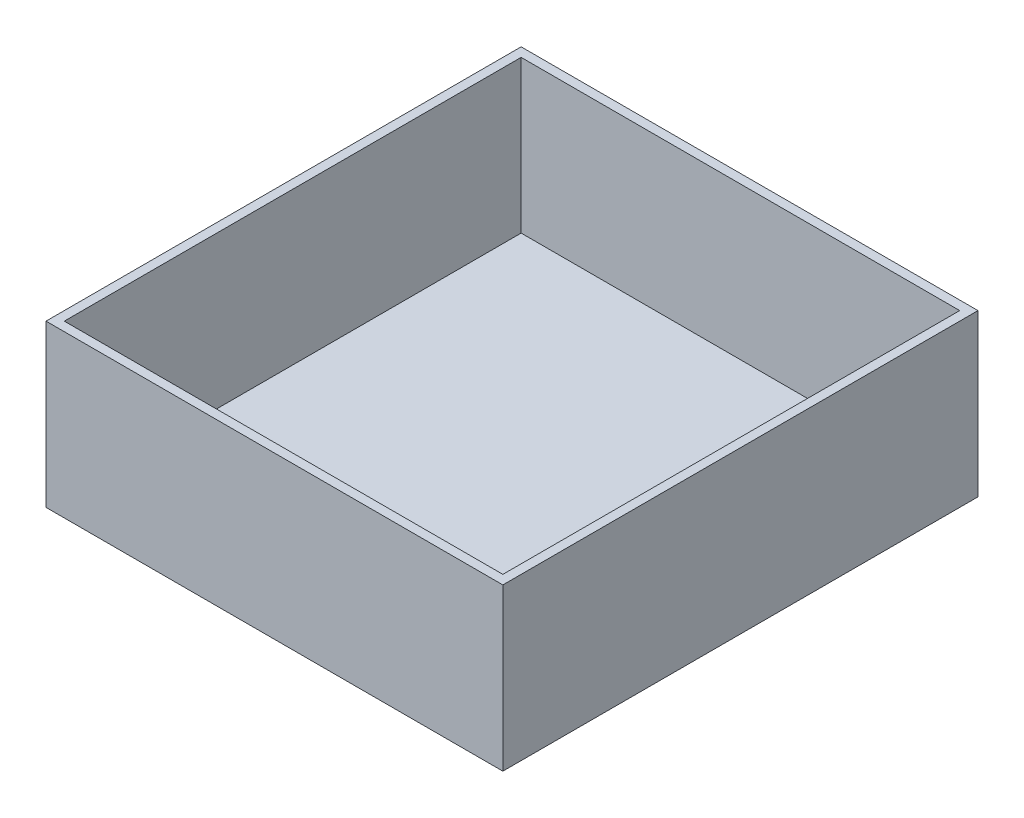
ISO-10303-21;
HEADER;
FILE_DESCRIPTION(('STEP AP214'),'2;1');
FILE_NAME('part.step','',(''),(''),'','','');
FILE_SCHEMA(('AUTOMOTIVE_DESIGN { 1 0 10303 214 1 1 1 1 }'));
ENDSEC;
DATA;
#1=APPLICATION_CONTEXT('core data for automotive mechanical design processes');
#2=APPLICATION_PROTOCOL_DEFINITION('international standard','automotive_design',2000,#1);
#3=PRODUCT_CONTEXT('',#1,'mechanical');
#4=PRODUCT('Part','Part','',(#3));
#5=PRODUCT_RELATED_PRODUCT_CATEGORY('part','',(#4));
#6=PRODUCT_DEFINITION_FORMATION('','',#4);
#7=PRODUCT_DEFINITION_CONTEXT('part definition',#1,'design');
#8=PRODUCT_DEFINITION('design','',#6,#7);
#9=PRODUCT_DEFINITION_SHAPE('','',#8);
#10=(LENGTH_UNIT() NAMED_UNIT(*) SI_UNIT(.MILLI.,.METRE.));
#11=(NAMED_UNIT(*) PLANE_ANGLE_UNIT() SI_UNIT($,.RADIAN.));
#12=(NAMED_UNIT(*) SI_UNIT($,.STERADIAN.) SOLID_ANGLE_UNIT());
#13=UNCERTAINTY_MEASURE_WITH_UNIT(LENGTH_MEASURE(1.E-05),#10,'distance_accuracy_value','');
#14=(GEOMETRIC_REPRESENTATION_CONTEXT(3) GLOBAL_UNCERTAINTY_ASSIGNED_CONTEXT((#13)) GLOBAL_UNIT_ASSIGNED_CONTEXT((#10,
#11,#12)) REPRESENTATION_CONTEXT('',''));
#15=CARTESIAN_POINT('',(0.,0.,0.));
#16=DIRECTION('',(0.,0.,1.));
#17=DIRECTION('',(1.,0.,0.));
#18=AXIS2_PLACEMENT_3D('',#15,#16,#17);
#19=CARTESIAN_POINT('',(79.375,3.175,82.55));
#20=DIRECTION('',(-1.,0.,0.));
#21=DIRECTION('',(0.,0.,1.));
#22=AXIS2_PLACEMENT_3D('',#19,#20,#21);
#23=PLANE('',#22);
#24=DIRECTION('',(0.,0.,-1.));
#25=VECTOR('',#24,1.);
#26=CARTESIAN_POINT('',(79.375,0.,82.55));
#27=LINE('',#26,#25);
#28=CARTESIAN_POINT('',(79.375,0.,82.55));
#29=VERTEX_POINT('',#28);
#30=CARTESIAN_POINT('',(79.375,0.,-82.55));
#31=VERTEX_POINT('',#30);
#32=EDGE_CURVE('E148',#29,#31,#27,.T.);
#33=ORIENTED_EDGE('',*,*,#32,.T.);
#34=DIRECTION('',(0.,-1.,0.));
#35=VECTOR('',#34,1.);
#36=CARTESIAN_POINT('',(79.375,3.175,-82.55));
#37=LINE('',#36,#35);
#38=CARTESIAN_POINT('',(79.375,56.0578,-82.55));
#39=VERTEX_POINT('',#38);
#40=EDGE_CURVE('E11',#39,#31,#37,.T.);
#41=ORIENTED_EDGE('',*,*,#40,.F.);
#42=DIRECTION('',(0.,0.,-1.));
#43=VECTOR('',#42,1.);
#44=CARTESIAN_POINT('',(79.375,56.0578,82.55));
#45=LINE('',#44,#43);
#46=CARTESIAN_POINT('',(79.375,56.0578,82.55));
#47=VERTEX_POINT('',#46);
#48=EDGE_CURVE('E139',#47,#39,#45,.T.);
#49=ORIENTED_EDGE('',*,*,#48,.F.);
#50=DIRECTION('',(0.,-1.,0.));
#51=VECTOR('',#50,1.);
#52=CARTESIAN_POINT('',(79.375,3.175,82.55));
#53=LINE('',#52,#51);
#54=EDGE_CURVE('E156',#47,#29,#53,.T.);
#55=ORIENTED_EDGE('',*,*,#54,.T.);
#56=EDGE_LOOP('',(#33,#41,#49,#55));
#57=FACE_BOUND('',#56,.T.);
#58=ADVANCED_FACE('F31',(#57),#23,.F.);
#59=CARTESIAN_POINT('',(-79.375,3.175,-82.55));
#60=DIRECTION('',(0.,0.,1.));
#61=DIRECTION('',(1.,0.,0.));
#62=AXIS2_PLACEMENT_3D('',#59,#60,#61);
#63=PLANE('',#62);
#64=DIRECTION('',(-1.,0.,0.));
#65=VECTOR('',#64,1.);
#66=CARTESIAN_POINT('',(-79.375,0.,-82.55));
#67=LINE('',#66,#65);
#68=CARTESIAN_POINT('',(-79.375,0.,-82.55));
#69=VERTEX_POINT('',#68);
#70=EDGE_CURVE('E151',#31,#69,#67,.T.);
#71=ORIENTED_EDGE('',*,*,#70,.T.);
#72=DIRECTION('',(0.,-1.,0.));
#73=VECTOR('',#72,1.);
#74=CARTESIAN_POINT('',(-79.375,3.175,-82.55));
#75=LINE('',#74,#73);
#76=CARTESIAN_POINT('',(-79.375,56.0578,-82.55));
#77=VERTEX_POINT('',#76);
#78=EDGE_CURVE('E38',#77,#69,#75,.T.);
#79=ORIENTED_EDGE('',*,*,#78,.F.);
#80=DIRECTION('',(-1.,0.,0.));
#81=VECTOR('',#80,1.);
#82=CARTESIAN_POINT('',(79.375,56.0578,-82.55));
#83=LINE('',#82,#81);
#84=EDGE_CURVE('E142',#39,#77,#83,.T.);
#85=ORIENTED_EDGE('',*,*,#84,.F.);
#86=ORIENTED_EDGE('',*,*,#40,.T.);
#87=EDGE_LOOP('',(#71,#79,#85,#86));
#88=FACE_BOUND('',#87,.T.);
#89=ADVANCED_FACE('F174',(#88),#63,.F.);
#90=CARTESIAN_POINT('',(-79.375,3.175,82.55));
#91=DIRECTION('',(1.,0.,0.));
#92=DIRECTION('',(0.,0.,-1.));
#93=AXIS2_PLACEMENT_3D('',#90,#91,#92);
#94=PLANE('',#93);
#95=DIRECTION('',(0.,0.,1.));
#96=VECTOR('',#95,1.);
#97=CARTESIAN_POINT('',(-79.375,0.,82.55));
#98=LINE('',#97,#96);
#99=CARTESIAN_POINT('',(-79.375,0.,82.55));
#100=VERTEX_POINT('',#99);
#101=EDGE_CURVE('E153',#69,#100,#98,.T.);
#102=ORIENTED_EDGE('',*,*,#101,.T.);
#103=DIRECTION('',(0.,-1.,0.));
#104=VECTOR('',#103,1.);
#105=CARTESIAN_POINT('',(-79.375,3.175,82.55));
#106=LINE('',#105,#104);
#107=CARTESIAN_POINT('',(-79.375,56.0578,82.55));
#108=VERTEX_POINT('',#107);
#109=EDGE_CURVE('E158',#108,#100,#106,.T.);
#110=ORIENTED_EDGE('',*,*,#109,.F.);
#111=DIRECTION('',(0.,0.,1.));
#112=VECTOR('',#111,1.);
#113=CARTESIAN_POINT('',(-79.375,56.0578,-82.55));
#114=LINE('',#113,#112);
#115=EDGE_CURVE('E145',#77,#108,#114,.T.);
#116=ORIENTED_EDGE('',*,*,#115,.F.);
#117=ORIENTED_EDGE('',*,*,#78,.T.);
#118=EDGE_LOOP('',(#102,#110,#116,#117));
#119=FACE_BOUND('',#118,.T.);
#120=ADVANCED_FACE('F163',(#119),#94,.F.);
#121=CARTESIAN_POINT('',(-79.375,3.175,82.55));
#122=DIRECTION('',(0.,0.,-1.));
#123=DIRECTION('',(-1.,0.,0.));
#124=AXIS2_PLACEMENT_3D('',#121,#122,#123);
#125=PLANE('',#124);
#126=DIRECTION('',(1.,0.,0.));
#127=VECTOR('',#126,1.);
#128=CARTESIAN_POINT('',(-79.375,0.,82.55));
#129=LINE('',#128,#127);
#130=EDGE_CURVE('E53',#100,#29,#129,.T.);
#131=ORIENTED_EDGE('',*,*,#130,.T.);
#132=ORIENTED_EDGE('',*,*,#54,.F.);
#133=DIRECTION('',(1.,0.,0.));
#134=VECTOR('',#133,1.);
#135=CARTESIAN_POINT('',(-79.375,56.0578,82.55));
#136=LINE('',#135,#134);
#137=EDGE_CURVE('E113',#108,#47,#136,.T.);
#138=ORIENTED_EDGE('',*,*,#137,.F.);
#139=ORIENTED_EDGE('',*,*,#109,.T.);
#140=EDGE_LOOP('',(#131,#132,#138,#139));
#141=FACE_BOUND('',#140,.T.);
#142=ADVANCED_FACE('F172',(#141),#125,.F.);
#143=CARTESIAN_POINT('',(79.375,0.,-82.55));
#144=DIRECTION('',(0.,-1.,0.));
#145=DIRECTION('',(0.,0.,-1.));
#146=AXIS2_PLACEMENT_3D('',#143,#144,#145);
#147=PLANE('',#146);
#148=ORIENTED_EDGE('',*,*,#32,.F.);
#149=ORIENTED_EDGE('',*,*,#130,.F.);
#150=ORIENTED_EDGE('',*,*,#101,.F.);
#151=ORIENTED_EDGE('',*,*,#70,.F.);
#152=EDGE_LOOP('',(#148,#149,#150,#151));
#153=FACE_BOUND('',#152,.T.);
#154=ADVANCED_FACE('F168',(#153),#147,.T.);
#155=CARTESIAN_POINT('',(79.375,56.0578,82.55));
#156=DIRECTION('',(0.,1.,0.));
#157=DIRECTION('',(0.,0.,1.));
#158=AXIS2_PLACEMENT_3D('',#155,#156,#157);
#159=PLANE('',#158);
#160=ORIENTED_EDGE('',*,*,#137,.T.);
#161=ORIENTED_EDGE('',*,*,#48,.T.);
#162=ORIENTED_EDGE('',*,*,#84,.T.);
#163=ORIENTED_EDGE('',*,*,#115,.T.);
#164=EDGE_LOOP('',(#160,#161,#162,#163));
#165=FACE_BOUND('',#164,.T.);
#166=DIRECTION('',(0.,0.,-1.));
#167=VECTOR('',#166,1.);
#168=CARTESIAN_POINT('',(76.2,56.0578,79.375));
#169=LINE('',#168,#167);
#170=CARTESIAN_POINT('',(76.2,56.0578,79.375));
#171=VERTEX_POINT('',#170);
#172=CARTESIAN_POINT('',(76.2,56.0578,-79.375));
#173=VERTEX_POINT('',#172);
#174=EDGE_CURVE('E105',#171,#173,#169,.T.);
#175=ORIENTED_EDGE('',*,*,#174,.F.);
#176=DIRECTION('',(1.,0.,0.));
#177=VECTOR('',#176,1.);
#178=CARTESIAN_POINT('',(-76.2,56.0578,79.375));
#179=LINE('',#178,#177);
#180=CARTESIAN_POINT('',(-76.2,56.0578,79.375));
#181=VERTEX_POINT('',#180);
#182=EDGE_CURVE('E97',#181,#171,#179,.T.);
#183=ORIENTED_EDGE('',*,*,#182,.F.);
#184=DIRECTION('',(0.,0.,1.));
#185=VECTOR('',#184,1.);
#186=CARTESIAN_POINT('',(-76.2,56.0578,-79.375));
#187=LINE('',#186,#185);
#188=CARTESIAN_POINT('',(-76.2,56.0578,-79.375));
#189=VERTEX_POINT('',#188);
#190=EDGE_CURVE('E121',#189,#181,#187,.T.);
#191=ORIENTED_EDGE('',*,*,#190,.F.);
#192=DIRECTION('',(-1.,0.,0.));
#193=VECTOR('',#192,1.);
#194=CARTESIAN_POINT('',(76.2,56.0578,-79.375));
#195=LINE('',#194,#193);
#196=EDGE_CURVE('E119',#173,#189,#195,.T.);
#197=ORIENTED_EDGE('',*,*,#196,.F.);
#198=EDGE_LOOP('',(#175,#183,#191,#197));
#199=FACE_BOUND('',#198,.T.);
#200=ADVANCED_FACE('F117',(#165,#199),#159,.T.);
#201=CARTESIAN_POINT('',(-76.2,56.0578,79.375));
#202=DIRECTION('',(0.,0.,-1.));
#203=DIRECTION('',(-1.,0.,0.));
#204=AXIS2_PLACEMENT_3D('',#201,#202,#203);
#205=PLANE('',#204);
#206=DIRECTION('',(1.,0.,0.));
#207=VECTOR('',#206,1.);
#208=CARTESIAN_POINT('',(-76.2,3.175,79.375));
#209=LINE('',#208,#207);
#210=CARTESIAN_POINT('',(-76.2,3.175,79.375));
#211=VERTEX_POINT('',#210);
#212=CARTESIAN_POINT('',(76.2,3.175,79.375));
#213=VERTEX_POINT('',#212);
#214=EDGE_CURVE('E125',#211,#213,#209,.T.);
#215=ORIENTED_EDGE('',*,*,#214,.F.);
#216=DIRECTION('',(0.,-1.,0.));
#217=VECTOR('',#216,1.);
#218=CARTESIAN_POINT('',(-76.2,56.0578,79.375));
#219=LINE('',#218,#217);
#220=EDGE_CURVE('E45',#181,#211,#219,.T.);
#221=ORIENTED_EDGE('',*,*,#220,.F.);
#222=ORIENTED_EDGE('',*,*,#182,.T.);
#223=DIRECTION('',(0.,-1.,0.));
#224=VECTOR('',#223,1.);
#225=CARTESIAN_POINT('',(76.2,56.0578,79.375));
#226=LINE('',#225,#224);
#227=EDGE_CURVE('E100',#171,#213,#226,.T.);
#228=ORIENTED_EDGE('',*,*,#227,.T.);
#229=EDGE_LOOP('',(#215,#221,#222,#228));
#230=FACE_BOUND('',#229,.T.);
#231=ADVANCED_FACE('F99',(#230),#205,.T.);
#232=CARTESIAN_POINT('',(76.2,56.0578,79.375));
#233=DIRECTION('',(-1.,0.,0.));
#234=DIRECTION('',(0.,0.,1.));
#235=AXIS2_PLACEMENT_3D('',#232,#233,#234);
#236=PLANE('',#235);
#237=DIRECTION('',(0.,0.,-1.));
#238=VECTOR('',#237,1.);
#239=CARTESIAN_POINT('',(76.2,3.175,79.375));
#240=LINE('',#239,#238);
#241=CARTESIAN_POINT('',(76.2,3.175,-79.375));
#242=VERTEX_POINT('',#241);
#243=EDGE_CURVE('E112',#213,#242,#240,.T.);
#244=ORIENTED_EDGE('',*,*,#243,.F.);
#245=ORIENTED_EDGE('',*,*,#227,.F.);
#246=ORIENTED_EDGE('',*,*,#174,.T.);
#247=DIRECTION('',(0.,-1.,0.));
#248=VECTOR('',#247,1.);
#249=CARTESIAN_POINT('',(76.2,56.0578,-79.375));
#250=LINE('',#249,#248);
#251=EDGE_CURVE('E114',#173,#242,#250,.T.);
#252=ORIENTED_EDGE('',*,*,#251,.T.);
#253=EDGE_LOOP('',(#244,#245,#246,#252));
#254=FACE_BOUND('',#253,.T.);
#255=ADVANCED_FACE('F109',(#254),#236,.T.);
#256=CARTESIAN_POINT('',(76.2,56.0578,-79.375));
#257=DIRECTION('',(0.,0.,1.));
#258=DIRECTION('',(1.,0.,0.));
#259=AXIS2_PLACEMENT_3D('',#256,#257,#258);
#260=PLANE('',#259);
#261=DIRECTION('',(-1.,0.,0.));
#262=VECTOR('',#261,1.);
#263=CARTESIAN_POINT('',(76.2,3.175,-79.375));
#264=LINE('',#263,#262);
#265=CARTESIAN_POINT('',(-76.2,3.175,-79.375));
#266=VERTEX_POINT('',#265);
#267=EDGE_CURVE('E128',#242,#266,#264,.T.);
#268=ORIENTED_EDGE('',*,*,#267,.F.);
#269=ORIENTED_EDGE('',*,*,#251,.F.);
#270=ORIENTED_EDGE('',*,*,#196,.T.);
#271=DIRECTION('',(0.,-1.,0.));
#272=VECTOR('',#271,1.);
#273=CARTESIAN_POINT('',(-76.2,56.0578,-79.375));
#274=LINE('',#273,#272);
#275=EDGE_CURVE('E134',#189,#266,#274,.T.);
#276=ORIENTED_EDGE('',*,*,#275,.T.);
#277=EDGE_LOOP('',(#268,#269,#270,#276));
#278=FACE_BOUND('',#277,.T.);
#279=ADVANCED_FACE('F197',(#278),#260,.T.);
#280=CARTESIAN_POINT('',(-76.2,56.0578,-79.375));
#281=DIRECTION('',(1.,0.,0.));
#282=DIRECTION('',(0.,0.,-1.));
#283=AXIS2_PLACEMENT_3D('',#280,#281,#282);
#284=PLANE('',#283);
#285=DIRECTION('',(0.,0.,1.));
#286=VECTOR('',#285,1.);
#287=CARTESIAN_POINT('',(-76.2,3.175,-79.375));
#288=LINE('',#287,#286);
#289=EDGE_CURVE('E106',#266,#211,#288,.T.);
#290=ORIENTED_EDGE('',*,*,#289,.F.);
#291=ORIENTED_EDGE('',*,*,#275,.F.);
#292=ORIENTED_EDGE('',*,*,#190,.T.);
#293=ORIENTED_EDGE('',*,*,#220,.T.);
#294=EDGE_LOOP('',(#290,#291,#292,#293));
#295=FACE_BOUND('',#294,.T.);
#296=ADVANCED_FACE('F189',(#295),#284,.T.);
#297=CARTESIAN_POINT('',(79.375,3.175,-82.55));
#298=DIRECTION('',(0.,-1.,0.));
#299=DIRECTION('',(0.,0.,-1.));
#300=AXIS2_PLACEMENT_3D('',#297,#298,#299);
#301=PLANE('',#300);
#302=ORIENTED_EDGE('',*,*,#289,.T.);
#303=ORIENTED_EDGE('',*,*,#214,.T.);
#304=ORIENTED_EDGE('',*,*,#243,.T.);
#305=ORIENTED_EDGE('',*,*,#267,.T.);
#306=EDGE_LOOP('',(#302,#303,#304,#305));
#307=FACE_BOUND('',#306,.T.);
#308=ADVANCED_FACE('F186',(#307),#301,.F.);
#309=CLOSED_SHELL('',(#58,#89,#120,#142,#154,#200,#231,#255,#279,#296,#308));
#310=MANIFOLD_SOLID_BREP('B2',#309);
#311=ADVANCED_BREP_SHAPE_REPRESENTATION('',(#18,#310),#14);
#312=SHAPE_DEFINITION_REPRESENTATION(#9,#311);
ENDSEC;
END-ISO-10303-21;
